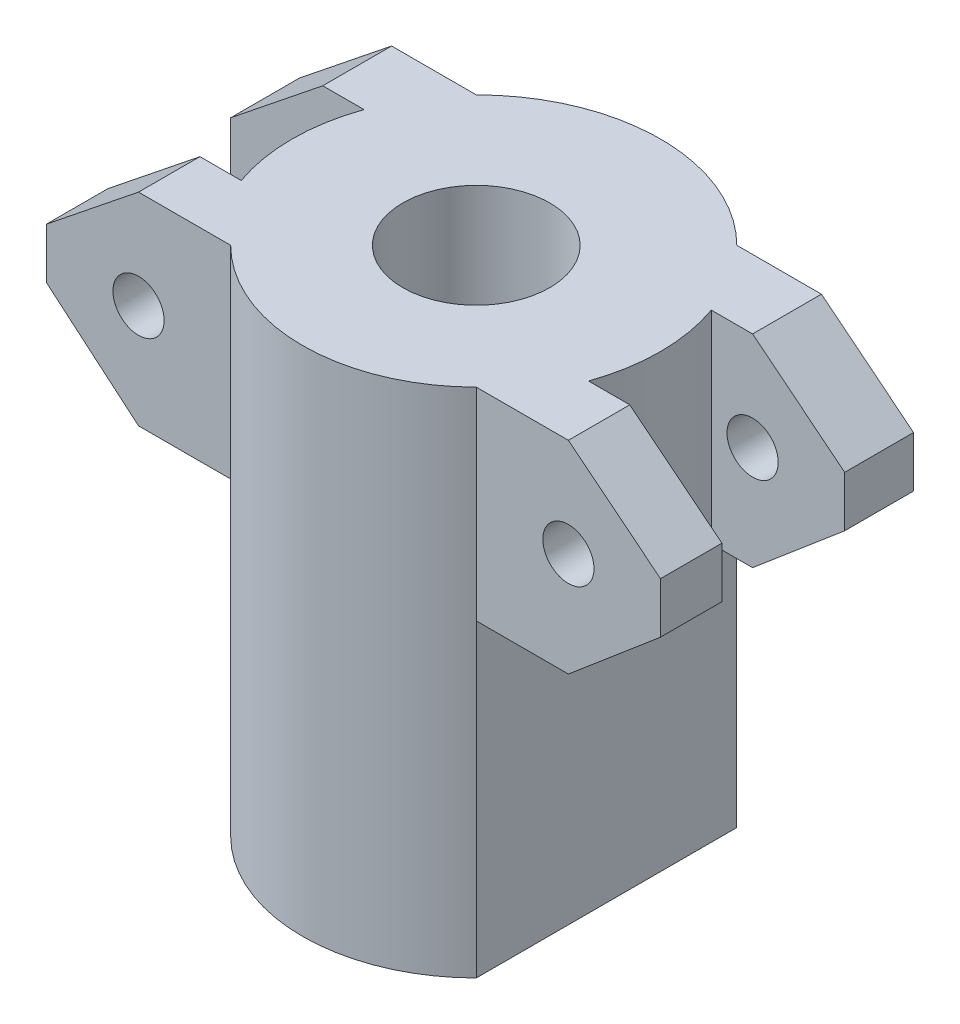
ISO-10303-21;
HEADER;
FILE_DESCRIPTION(('STEP AP214'),'2;1');
FILE_NAME('part.step','',(''),(''),'','','');
FILE_SCHEMA(('AUTOMOTIVE_DESIGN { 1 0 10303 214 1 1 1 1 }'));
ENDSEC;
DATA;
#1=APPLICATION_CONTEXT('core data for automotive mechanical design processes');
#2=APPLICATION_PROTOCOL_DEFINITION('international standard','automotive_design',2000,#1);
#3=PRODUCT_CONTEXT('',#1,'mechanical');
#4=PRODUCT('Part','Part','',(#3));
#5=PRODUCT_RELATED_PRODUCT_CATEGORY('part','',(#4));
#6=PRODUCT_DEFINITION_FORMATION('','',#4);
#7=PRODUCT_DEFINITION_CONTEXT('part definition',#1,'design');
#8=PRODUCT_DEFINITION('design','',#6,#7);
#9=PRODUCT_DEFINITION_SHAPE('','',#8);
#10=(LENGTH_UNIT() NAMED_UNIT(*) SI_UNIT(.MILLI.,.METRE.));
#11=(NAMED_UNIT(*) PLANE_ANGLE_UNIT() SI_UNIT($,.RADIAN.));
#12=(NAMED_UNIT(*) SI_UNIT($,.STERADIAN.) SOLID_ANGLE_UNIT());
#13=UNCERTAINTY_MEASURE_WITH_UNIT(LENGTH_MEASURE(1.E-05),#10,'distance_accuracy_value','');
#14=(GEOMETRIC_REPRESENTATION_CONTEXT(3) GLOBAL_UNCERTAINTY_ASSIGNED_CONTEXT((#13)) GLOBAL_UNIT_ASSIGNED_CONTEXT((#10,
#11,#12)) REPRESENTATION_CONTEXT('',''));
#15=CARTESIAN_POINT('',(0.,0.,0.));
#16=DIRECTION('',(0.,0.,1.));
#17=DIRECTION('',(1.,0.,0.));
#18=AXIS2_PLACEMENT_3D('',#15,#16,#17);
#19=CARTESIAN_POINT('',(0.,50.,0.));
#20=DIRECTION('',(0.,-1.,0.));
#21=DIRECTION('',(0.,0.,-1.));
#22=AXIS2_PLACEMENT_3D('',#19,#20,#21);
#23=PLANE('',#22);
#24=CARTESIAN_POINT('',(0.,50.,0.));
#25=DIRECTION('',(0.,1.,0.));
#26=DIRECTION('',(0.,0.,1.));
#27=AXIS2_PLACEMENT_3D('',#24,#25,#26);
#28=CIRCLE('',#27,7.17980327136209);
#29=CARTESIAN_POINT('',(0.,50.,7.17980327136211));
#30=VERTEX_POINT('',#29);
#31=EDGE_CURVE('E326',#30,#30,#28,.T.);
#32=ORIENTED_EDGE('',*,*,#31,.F.);
#33=EDGE_LOOP('',(#32));
#34=FACE_BOUND('',#33,.T.);
#35=DIRECTION('',(0.,0.,1.));
#36=VECTOR('',#35,1.);
#37=CARTESIAN_POINT('',(-21.,50.,-18.));
#38=LINE('',#37,#36);
#39=CARTESIAN_POINT('',(-21.,50.,6.));
#40=VERTEX_POINT('',#39);
#41=CARTESIAN_POINT('',(-21.,50.,12.));
#42=VERTEX_POINT('',#41);
#43=EDGE_CURVE('E434',#40,#42,#38,.T.);
#44=ORIENTED_EDGE('',*,*,#43,.T.);
#45=DIRECTION('',(1.,0.,0.));
#46=VECTOR('',#45,1.);
#47=CARTESIAN_POINT('',(-30.,50.,12.));
#48=LINE('',#47,#46);
#49=CARTESIAN_POINT('',(-12.,50.,12.));
#50=VERTEX_POINT('',#49);
#51=EDGE_CURVE('E340',#42,#50,#48,.T.);
#52=ORIENTED_EDGE('',*,*,#51,.T.);
#53=CARTESIAN_POINT('',(0.,50.,0.));
#54=DIRECTION('',(0.,1.,0.));
#55=DIRECTION('',(0.,0.,1.));
#56=AXIS2_PLACEMENT_3D('',#53,#54,#55);
#57=CIRCLE('',#56,16.9705627484772);
#58=CARTESIAN_POINT('',(12.,50.,12.));
#59=VERTEX_POINT('',#58);
#60=EDGE_CURVE('E342',#50,#59,#57,.T.);
#61=ORIENTED_EDGE('',*,*,#60,.T.);
#62=DIRECTION('',(1.,0.,0.));
#63=VECTOR('',#62,1.);
#64=CARTESIAN_POINT('',(30.,50.,12.));
#65=LINE('',#64,#63);
#66=CARTESIAN_POINT('',(21.,50.,12.));
#67=VERTEX_POINT('',#66);
#68=EDGE_CURVE('E344',#59,#67,#65,.T.);
#69=ORIENTED_EDGE('',*,*,#68,.T.);
#70=DIRECTION('',(0.,0.,1.));
#71=VECTOR('',#70,1.);
#72=CARTESIAN_POINT('',(21.,50.,-18.));
#73=LINE('',#72,#71);
#74=CARTESIAN_POINT('',(21.,50.,6.));
#75=VERTEX_POINT('',#74);
#76=EDGE_CURVE('E441',#75,#67,#73,.T.);
#77=ORIENTED_EDGE('',*,*,#76,.F.);
#78=DIRECTION('',(-1.,0.,0.));
#79=VECTOR('',#78,1.);
#80=CARTESIAN_POINT('',(16.9638434938271,50.,6.));
#81=LINE('',#80,#79);
#82=CARTESIAN_POINT('',(16.9638434938271,50.,6.));
#83=VERTEX_POINT('',#82);
#84=EDGE_CURVE('E347',#75,#83,#81,.T.);
#85=ORIENTED_EDGE('',*,*,#84,.T.);
#86=CARTESIAN_POINT('',(0.,50.,0.));
#87=DIRECTION('',(0.,1.,0.));
#88=DIRECTION('',(0.,0.,-1.));
#89=AXIS2_PLACEMENT_3D('',#86,#87,#88);
#90=CIRCLE('',#89,17.9936651653592);
#91=CARTESIAN_POINT('',(16.9638434938271,50.,-6.));
#92=VERTEX_POINT('',#91);
#93=EDGE_CURVE('E349',#83,#92,#90,.T.);
#94=ORIENTED_EDGE('',*,*,#93,.T.);
#95=DIRECTION('',(1.,0.,0.));
#96=VECTOR('',#95,1.);
#97=CARTESIAN_POINT('',(30.,50.,-6.));
#98=LINE('',#97,#96);
#99=CARTESIAN_POINT('',(21.,50.,-6.));
#100=VERTEX_POINT('',#99);
#101=EDGE_CURVE('E351',#92,#100,#98,.T.);
#102=ORIENTED_EDGE('',*,*,#101,.T.);
#103=CARTESIAN_POINT('',(21.,50.,-12.7279220613578));
#104=VERTEX_POINT('',#103);
#105=EDGE_CURVE('E438',#104,#100,#73,.T.);
#106=ORIENTED_EDGE('',*,*,#105,.F.);
#107=DIRECTION('',(-1.,0.,0.));
#108=VECTOR('',#107,1.);
#109=CARTESIAN_POINT('',(30.,50.,-12.7279220613578));
#110=LINE('',#109,#108);
#111=CARTESIAN_POINT('',(12.7279220613578,50.,-12.7279220613578));
#112=VERTEX_POINT('',#111);
#113=EDGE_CURVE('E354',#104,#112,#110,.T.);
#114=ORIENTED_EDGE('',*,*,#113,.T.);
#115=CARTESIAN_POINT('',(0.,50.,0.));
#116=DIRECTION('',(0.,1.,0.));
#117=DIRECTION('',(0.,0.,-1.));
#118=AXIS2_PLACEMENT_3D('',#115,#116,#117);
#119=CIRCLE('',#118,18.);
#120=CARTESIAN_POINT('',(-12.7279220613578,50.,-12.7279220613578));
#121=VERTEX_POINT('',#120);
#122=EDGE_CURVE('E356',#112,#121,#119,.T.);
#123=ORIENTED_EDGE('',*,*,#122,.T.);
#124=DIRECTION('',(-1.,0.,0.));
#125=VECTOR('',#124,1.);
#126=CARTESIAN_POINT('',(-30.,50.,-12.7279220613578));
#127=LINE('',#126,#125);
#128=CARTESIAN_POINT('',(-21.,50.,-12.7279220613578));
#129=VERTEX_POINT('',#128);
#130=EDGE_CURVE('E225',#121,#129,#127,.T.);
#131=ORIENTED_EDGE('',*,*,#130,.T.);
#132=CARTESIAN_POINT('',(-21.,50.,-6.));
#133=VERTEX_POINT('',#132);
#134=EDGE_CURVE('E258',#129,#133,#38,.T.);
#135=ORIENTED_EDGE('',*,*,#134,.T.);
#136=DIRECTION('',(1.,0.,0.));
#137=VECTOR('',#136,1.);
#138=CARTESIAN_POINT('',(-30.,50.,-6.));
#139=LINE('',#138,#137);
#140=CARTESIAN_POINT('',(-16.9638434938271,50.,-6.));
#141=VERTEX_POINT('',#140);
#142=EDGE_CURVE('E333',#133,#141,#139,.T.);
#143=ORIENTED_EDGE('',*,*,#142,.T.);
#144=CARTESIAN_POINT('',(0.,50.,0.));
#145=DIRECTION('',(0.,1.,0.));
#146=DIRECTION('',(0.,0.,1.));
#147=AXIS2_PLACEMENT_3D('',#144,#145,#146);
#148=CIRCLE('',#147,17.9936651653592);
#149=CARTESIAN_POINT('',(-16.9638434938271,50.,5.99999999999999));
#150=VERTEX_POINT('',#149);
#151=EDGE_CURVE('E335',#141,#150,#148,.T.);
#152=ORIENTED_EDGE('',*,*,#151,.T.);
#153=DIRECTION('',(-1.,0.,0.));
#154=VECTOR('',#153,1.);
#155=CARTESIAN_POINT('',(-16.9638434938271,50.,6.));
#156=LINE('',#155,#154);
#157=EDGE_CURVE('E337',#150,#40,#156,.T.);
#158=ORIENTED_EDGE('',*,*,#157,.T.);
#159=EDGE_LOOP('',(#44,#52,#61,#69,#77,#85,#94,#102,#106,#114,#123,#131,#135,#143,#152,#158));
#160=FACE_BOUND('',#159,.T.);
#161=ADVANCED_FACE('F36',(#34,#160),#23,.F.);
#162=CARTESIAN_POINT('',(0.,0.,0.));
#163=DIRECTION('',(0.,-1.,0.));
#164=DIRECTION('',(0.,0.,-1.));
#165=AXIS2_PLACEMENT_3D('',#162,#163,#164);
#166=PLANE('',#165);
#167=CARTESIAN_POINT('',(0.,0.,0.));
#168=DIRECTION('',(0.,1.,0.));
#169=DIRECTION('',(0.,0.,1.));
#170=AXIS2_PLACEMENT_3D('',#167,#168,#169);
#171=CIRCLE('',#170,7.17980327136209);
#172=CARTESIAN_POINT('',(0.,0.,7.17980327136211));
#173=VERTEX_POINT('',#172);
#174=EDGE_CURVE('E325',#173,#173,#171,.T.);
#175=ORIENTED_EDGE('',*,*,#174,.T.);
#176=EDGE_LOOP('',(#175));
#177=FACE_BOUND('',#176,.T.);
#178=CARTESIAN_POINT('',(0.,0.,0.));
#179=DIRECTION('',(0.,1.,0.));
#180=DIRECTION('',(0.,0.,-1.));
#181=AXIS2_PLACEMENT_3D('',#178,#179,#180);
#182=CIRCLE('',#181,18.);
#183=CARTESIAN_POINT('',(12.,0.,-13.4164078649987));
#184=VERTEX_POINT('',#183);
#185=CARTESIAN_POINT('',(-12.,0.,-13.4164078649987));
#186=VERTEX_POINT('',#185);
#187=EDGE_CURVE('E215',#184,#186,#182,.T.);
#188=ORIENTED_EDGE('',*,*,#187,.F.);
#189=DIRECTION('',(0.,0.,1.));
#190=VECTOR('',#189,1.);
#191=CARTESIAN_POINT('',(12.,0.,-18.));
#192=LINE('',#191,#190);
#193=CARTESIAN_POINT('',(12.,0.,12.));
#194=VERTEX_POINT('',#193);
#195=EDGE_CURVE('E239',#184,#194,#192,.T.);
#196=ORIENTED_EDGE('',*,*,#195,.T.);
#197=CARTESIAN_POINT('',(0.,0.,0.));
#198=DIRECTION('',(0.,1.,0.));
#199=DIRECTION('',(0.,0.,1.));
#200=AXIS2_PLACEMENT_3D('',#197,#198,#199);
#201=CIRCLE('',#200,16.9705627484772);
#202=CARTESIAN_POINT('',(-12.,0.,12.));
#203=VERTEX_POINT('',#202);
#204=EDGE_CURVE('E226',#203,#194,#201,.T.);
#205=ORIENTED_EDGE('',*,*,#204,.F.);
#206=DIRECTION('',(0.,0.,1.));
#207=VECTOR('',#206,1.);
#208=CARTESIAN_POINT('',(-12.,0.,-18.));
#209=LINE('',#208,#207);
#210=EDGE_CURVE('E231',#186,#203,#209,.T.);
#211=ORIENTED_EDGE('',*,*,#210,.F.);
#212=EDGE_LOOP('',(#188,#196,#205,#211));
#213=FACE_BOUND('',#212,.T.);
#214=ADVANCED_FACE('F238',(#177,#213),#166,.T.);
#215=CARTESIAN_POINT('',(-30.,50.,-12.7279220613578));
#216=DIRECTION('',(0.,0.,1.));
#217=DIRECTION('',(1.,0.,0.));
#218=AXIS2_PLACEMENT_3D('',#215,#216,#217);
#219=PLANE('',#218);
#220=CARTESIAN_POINT('',(-21.,40.3819584385632,-12.7279220613578));
#221=DIRECTION('',(0.,0.,1.));
#222=DIRECTION('',(1.,0.,0.));
#223=AXIS2_PLACEMENT_3D('',#220,#221,#222);
#224=CIRCLE('',#223,2.5);
#225=CARTESIAN_POINT('',(-18.5,40.3819584385632,-12.7279220613578));
#226=VERTEX_POINT('',#225);
#227=EDGE_CURVE('E322',#226,#226,#224,.T.);
#228=ORIENTED_EDGE('',*,*,#227,.T.);
#229=EDGE_LOOP('',(#228));
#230=FACE_BOUND('',#229,.T.);
#231=DIRECTION('',(-0.780528192542637,-0.6251205808851,0.));
#232=VECTOR('',#231,1.);
#233=CARTESIAN_POINT('',(-26.4830183341849,45.608681865925,-12.7279220613578));
#234=LINE('',#233,#232);
#235=CARTESIAN_POINT('',(-30.,42.7919512943684,-12.7279220613578));
#236=VERTEX_POINT('',#235);
#237=EDGE_CURVE('E313',#129,#236,#234,.T.);
#238=ORIENTED_EDGE('',*,*,#237,.F.);
#239=ORIENTED_EDGE('',*,*,#130,.F.);
#240=DIRECTION('',(0.,-1.,0.));
#241=VECTOR('',#240,1.);
#242=CARTESIAN_POINT('',(-12.7279220613578,50.,-12.7279220613578));
#243=LINE('',#242,#241);
#244=CARTESIAN_POINT('',(-12.7279220613578,30.2209074789521,-12.7279220613578));
#245=VERTEX_POINT('',#244);
#246=EDGE_CURVE('E358',#121,#245,#243,.T.);
#247=ORIENTED_EDGE('',*,*,#246,.T.);
#248=DIRECTION('',(1.,0.,0.));
#249=VECTOR('',#248,1.);
#250=CARTESIAN_POINT('',(-30.,30.2209074789521,-12.7279220613578));
#251=LINE('',#250,#249);
#252=CARTESIAN_POINT('',(-21.,30.2209074789521,-12.7279220613578));
#253=VERTEX_POINT('',#252);
#254=EDGE_CURVE('E255',#253,#245,#251,.T.);
#255=ORIENTED_EDGE('',*,*,#254,.F.);
#256=DIRECTION('',(0.763160297776906,-0.646209223005262,0.));
#257=VECTOR('',#256,1.);
#258=CARTESIAN_POINT('',(-35.996004219522,42.9188377343777,-12.7279220613578));
#259=LINE('',#258,#257);
#260=CARTESIAN_POINT('',(-30.,37.8416956986605,-12.7279220613578));
#261=VERTEX_POINT('',#260);
#262=EDGE_CURVE('E307',#261,#253,#259,.T.);
#263=ORIENTED_EDGE('',*,*,#262,.F.);
#264=DIRECTION('',(0.,-1.,0.));
#265=VECTOR('',#264,1.);
#266=CARTESIAN_POINT('',(-30.,50.,-12.7279220613578));
#267=LINE('',#266,#265);
#268=EDGE_CURVE('E404',#236,#261,#267,.T.);
#269=ORIENTED_EDGE('',*,*,#268,.F.);
#270=EDGE_LOOP('',(#238,#239,#247,#255,#263,#269));
#271=FACE_BOUND('',#270,.T.);
#272=ADVANCED_FACE('F38',(#230,#271),#219,.F.);
#273=CARTESIAN_POINT('',(-30.,50.,-12.7279220613578));
#274=DIRECTION('',(1.,0.,0.));
#275=DIRECTION('',(0.,0.,-1.));
#276=AXIS2_PLACEMENT_3D('',#273,#274,#275);
#277=PLANE('',#276);
#278=DIRECTION('',(0.,0.,1.));
#279=VECTOR('',#278,1.);
#280=CARTESIAN_POINT('',(-30.,42.7919512943684,-18.));
#281=LINE('',#280,#279);
#282=CARTESIAN_POINT('',(-30.,42.7919512943684,-6.));
#283=VERTEX_POINT('',#282);
#284=EDGE_CURVE('E51',#236,#283,#281,.T.);
#285=ORIENTED_EDGE('',*,*,#284,.F.);
#286=ORIENTED_EDGE('',*,*,#268,.T.);
#287=DIRECTION('',(0.,0.,1.));
#288=VECTOR('',#287,1.);
#289=CARTESIAN_POINT('',(-30.,37.8416956986605,-18.));
#290=LINE('',#289,#288);
#291=CARTESIAN_POINT('',(-30.,37.8416956986605,-6.));
#292=VERTEX_POINT('',#291);
#293=EDGE_CURVE('E250',#261,#292,#290,.T.);
#294=ORIENTED_EDGE('',*,*,#293,.T.);
#295=DIRECTION('',(0.,-1.,0.));
#296=VECTOR('',#295,1.);
#297=CARTESIAN_POINT('',(-30.,50.,-6.));
#298=LINE('',#297,#296);
#299=EDGE_CURVE('E401',#283,#292,#298,.T.);
#300=ORIENTED_EDGE('',*,*,#299,.F.);
#301=EDGE_LOOP('',(#285,#286,#294,#300));
#302=FACE_BOUND('',#301,.T.);
#303=ADVANCED_FACE('F597',(#302),#277,.F.);
#304=CARTESIAN_POINT('',(-30.,50.,-6.));
#305=DIRECTION('',(0.,0.,-1.));
#306=DIRECTION('',(-1.,0.,0.));
#307=AXIS2_PLACEMENT_3D('',#304,#305,#306);
#308=PLANE('',#307);
#309=CARTESIAN_POINT('',(-21.,40.3819584385632,-6.));
#310=DIRECTION('',(0.,0.,-1.));
#311=DIRECTION('',(-1.,0.,0.));
#312=AXIS2_PLACEMENT_3D('',#309,#310,#311);
#313=CIRCLE('',#312,2.5);
#314=CARTESIAN_POINT('',(-23.5,40.3819584385632,-6.));
#315=VERTEX_POINT('',#314);
#316=EDGE_CURVE('E319',#315,#315,#313,.T.);
#317=ORIENTED_EDGE('',*,*,#316,.T.);
#318=EDGE_LOOP('',(#317));
#319=FACE_BOUND('',#318,.T.);
#320=DIRECTION('',(0.780528192542637,0.6251205808851,0.));
#321=VECTOR('',#320,1.);
#322=CARTESIAN_POINT('',(-26.4830183341849,45.608681865925,-6.));
#323=LINE('',#322,#321);
#324=EDGE_CURVE('E311',#283,#133,#323,.T.);
#325=ORIENTED_EDGE('',*,*,#324,.F.);
#326=ORIENTED_EDGE('',*,*,#299,.T.);
#327=DIRECTION('',(-0.763160297776906,0.646209223005262,0.));
#328=VECTOR('',#327,1.);
#329=CARTESIAN_POINT('',(-35.996004219522,42.9188377343777,-6.));
#330=LINE('',#329,#328);
#331=CARTESIAN_POINT('',(-21.,30.2209074789521,-6.));
#332=VERTEX_POINT('',#331);
#333=EDGE_CURVE('E305',#332,#292,#330,.T.);
#334=ORIENTED_EDGE('',*,*,#333,.F.);
#335=DIRECTION('',(-1.,0.,0.));
#336=VECTOR('',#335,1.);
#337=CARTESIAN_POINT('',(-30.,30.2209074789521,-6.));
#338=LINE('',#337,#336);
#339=CARTESIAN_POINT('',(-16.9638434938271,30.2209074789521,-6.));
#340=VERTEX_POINT('',#339);
#341=EDGE_CURVE('E264',#340,#332,#338,.T.);
#342=ORIENTED_EDGE('',*,*,#341,.F.);
#343=DIRECTION('',(0.,-1.,0.));
#344=VECTOR('',#343,1.);
#345=CARTESIAN_POINT('',(-16.9638434938271,50.,-6.));
#346=LINE('',#345,#344);
#347=EDGE_CURVE('E398',#141,#340,#346,.T.);
#348=ORIENTED_EDGE('',*,*,#347,.F.);
#349=ORIENTED_EDGE('',*,*,#142,.F.);
#350=EDGE_LOOP('',(#325,#326,#334,#342,#348,#349));
#351=FACE_BOUND('',#350,.T.);
#352=ADVANCED_FACE('F594',(#319,#351),#308,.F.);
#353=CARTESIAN_POINT('',(0.,50.,0.));
#354=DIRECTION('',(0.,-1.,0.));
#355=DIRECTION('',(0.,0.,-1.));
#356=AXIS2_PLACEMENT_3D('',#353,#354,#355);
#357=CYLINDRICAL_SURFACE('',#356,17.9936651653592);
#358=CARTESIAN_POINT('',(0.,30.2209074789521,0.));
#359=DIRECTION('',(0.,-1.,0.));
#360=DIRECTION('',(0.,0.,-1.));
#361=AXIS2_PLACEMENT_3D('',#358,#359,#360);
#362=CIRCLE('',#361,17.9936651653592);
#363=CARTESIAN_POINT('',(-16.9638434938271,30.2209074789521,6.));
#364=VERTEX_POINT('',#363);
#365=EDGE_CURVE('E262',#364,#340,#362,.T.);
#366=ORIENTED_EDGE('',*,*,#365,.F.);
#367=DIRECTION('',(0.,-1.,0.));
#368=VECTOR('',#367,1.);
#369=CARTESIAN_POINT('',(-16.9638434938271,50.,5.99999999999999));
#370=LINE('',#369,#368);
#371=EDGE_CURVE('E395',#150,#364,#370,.T.);
#372=ORIENTED_EDGE('',*,*,#371,.F.);
#373=ORIENTED_EDGE('',*,*,#151,.F.);
#374=ORIENTED_EDGE('',*,*,#347,.T.);
#375=EDGE_LOOP('',(#366,#372,#373,#374));
#376=FACE_BOUND('',#375,.T.);
#377=ADVANCED_FACE('F590',(#376),#357,.T.);
#378=CARTESIAN_POINT('',(-16.9638434938271,50.,6.));
#379=DIRECTION('',(0.,0.,1.));
#380=DIRECTION('',(1.,0.,0.));
#381=AXIS2_PLACEMENT_3D('',#378,#379,#380);
#382=PLANE('',#381);
#383=CARTESIAN_POINT('',(-21.,40.3819584385632,6.));
#384=DIRECTION('',(0.,0.,1.));
#385=DIRECTION('',(1.,0.,0.));
#386=AXIS2_PLACEMENT_3D('',#383,#384,#385);
#387=CIRCLE('',#386,2.5);
#388=CARTESIAN_POINT('',(-18.5,40.3819584385632,6.));
#389=VERTEX_POINT('',#388);
#390=EDGE_CURVE('E316',#389,#389,#387,.T.);
#391=ORIENTED_EDGE('',*,*,#390,.T.);
#392=EDGE_LOOP('',(#391));
#393=FACE_BOUND('',#392,.T.);
#394=DIRECTION('',(-0.780528192542637,-0.6251205808851,0.));
#395=VECTOR('',#394,1.);
#396=CARTESIAN_POINT('',(-18.5410755418905,51.9693385841691,6.));
#397=LINE('',#396,#395);
#398=CARTESIAN_POINT('',(-30.,42.7919512943684,6.));
#399=VERTEX_POINT('',#398);
#400=EDGE_CURVE('E309',#40,#399,#397,.T.);
#401=ORIENTED_EDGE('',*,*,#400,.F.);
#402=ORIENTED_EDGE('',*,*,#157,.F.);
#403=ORIENTED_EDGE('',*,*,#371,.T.);
#404=DIRECTION('',(1.,0.,0.));
#405=VECTOR('',#404,1.);
#406=CARTESIAN_POINT('',(-16.9638434938271,30.2209074789521,6.));
#407=LINE('',#406,#405);
#408=CARTESIAN_POINT('',(-21.,30.2209074789521,6.));
#409=VERTEX_POINT('',#408);
#410=EDGE_CURVE('E260',#409,#364,#407,.T.);
#411=ORIENTED_EDGE('',*,*,#410,.F.);
#412=DIRECTION('',(0.763160297776906,-0.646209223005262,0.));
#413=VECTOR('',#412,1.);
#414=CARTESIAN_POINT('',(-28.4035688558103,36.4899108478586,6.));
#415=LINE('',#414,#413);
#416=CARTESIAN_POINT('',(-30.,37.8416956986605,6.));
#417=VERTEX_POINT('',#416);
#418=EDGE_CURVE('E303',#417,#409,#415,.T.);
#419=ORIENTED_EDGE('',*,*,#418,.F.);
#420=DIRECTION('',(0.,-1.,0.));
#421=VECTOR('',#420,1.);
#422=CARTESIAN_POINT('',(-30.,50.,6.));
#423=LINE('',#422,#421);
#424=EDGE_CURVE('E392',#399,#417,#423,.T.);
#425=ORIENTED_EDGE('',*,*,#424,.F.);
#426=EDGE_LOOP('',(#401,#402,#403,#411,#419,#425));
#427=FACE_BOUND('',#426,.T.);
#428=ADVANCED_FACE('F587',(#393,#427),#382,.F.);
#429=CARTESIAN_POINT('',(-30.,50.,6.));
#430=DIRECTION('',(1.,0.,0.));
#431=DIRECTION('',(0.,0.,-1.));
#432=AXIS2_PLACEMENT_3D('',#429,#430,#431);
#433=PLANE('',#432);
#434=CARTESIAN_POINT('',(-30.,42.7919512943684,12.));
#435=VERTEX_POINT('',#434);
#436=EDGE_CURVE('E58',#399,#435,#281,.T.);
#437=ORIENTED_EDGE('',*,*,#436,.F.);
#438=ORIENTED_EDGE('',*,*,#424,.T.);
#439=CARTESIAN_POINT('',(-30.,37.8416956986605,12.));
#440=VERTEX_POINT('',#439);
#441=EDGE_CURVE('E251',#417,#440,#290,.T.);
#442=ORIENTED_EDGE('',*,*,#441,.T.);
#443=DIRECTION('',(0.,-1.,0.));
#444=VECTOR('',#443,1.);
#445=CARTESIAN_POINT('',(-30.,50.,12.));
#446=LINE('',#445,#444);
#447=EDGE_CURVE('E389',#435,#440,#446,.T.);
#448=ORIENTED_EDGE('',*,*,#447,.F.);
#449=EDGE_LOOP('',(#437,#438,#442,#448));
#450=FACE_BOUND('',#449,.T.);
#451=ADVANCED_FACE('F427',(#450),#433,.F.);
#452=CARTESIAN_POINT('',(-30.,50.,12.));
#453=DIRECTION('',(0.,0.,-1.));
#454=DIRECTION('',(-1.,0.,0.));
#455=AXIS2_PLACEMENT_3D('',#452,#453,#454);
#456=PLANE('',#455);
#457=CARTESIAN_POINT('',(-21.,40.3819584385632,12.));
#458=DIRECTION('',(0.,0.,-1.));
#459=DIRECTION('',(-1.,0.,0.));
#460=AXIS2_PLACEMENT_3D('',#457,#458,#459);
#461=CIRCLE('',#460,2.5);
#462=CARTESIAN_POINT('',(-23.5,40.3819584385632,12.));
#463=VERTEX_POINT('',#462);
#464=EDGE_CURVE('E315',#463,#463,#461,.T.);
#465=ORIENTED_EDGE('',*,*,#464,.T.);
#466=EDGE_LOOP('',(#465));
#467=FACE_BOUND('',#466,.T.);
#468=DIRECTION('',(0.780528192542637,0.6251205808851,0.));
#469=VECTOR('',#468,1.);
#470=CARTESIAN_POINT('',(-26.4830183341849,45.608681865925,12.));
#471=LINE('',#470,#469);
#472=EDGE_CURVE('E12',#435,#42,#471,.T.);
#473=ORIENTED_EDGE('',*,*,#472,.F.);
#474=ORIENTED_EDGE('',*,*,#447,.T.);
#475=DIRECTION('',(-0.763160297776906,0.646209223005262,0.));
#476=VECTOR('',#475,1.);
#477=CARTESIAN_POINT('',(-35.996004219522,42.9188377343777,12.));
#478=LINE('',#477,#476);
#479=CARTESIAN_POINT('',(-21.,30.2209074789521,12.));
#480=VERTEX_POINT('',#479);
#481=EDGE_CURVE('E44',#480,#440,#478,.T.);
#482=ORIENTED_EDGE('',*,*,#481,.F.);
#483=DIRECTION('',(-1.,0.,0.));
#484=VECTOR('',#483,1.);
#485=CARTESIAN_POINT('',(-30.,30.2209074789521,12.));
#486=LINE('',#485,#484);
#487=CARTESIAN_POINT('',(-12.,30.2209074789521,12.));
#488=VERTEX_POINT('',#487);
#489=EDGE_CURVE('E257',#488,#480,#486,.T.);
#490=ORIENTED_EDGE('',*,*,#489,.F.);
#491=DIRECTION('',(0.,-1.,0.));
#492=VECTOR('',#491,1.);
#493=CARTESIAN_POINT('',(-12.,50.,12.));
#494=LINE('',#493,#492);
#495=EDGE_CURVE('E386',#50,#488,#494,.T.);
#496=ORIENTED_EDGE('',*,*,#495,.F.);
#497=ORIENTED_EDGE('',*,*,#51,.F.);
#498=EDGE_LOOP('',(#473,#474,#482,#490,#496,#497));
#499=FACE_BOUND('',#498,.T.);
#500=ADVANCED_FACE('F429',(#467,#499),#456,.F.);
#501=CARTESIAN_POINT('',(30.,50.,12.));
#502=DIRECTION('',(0.,0.,-1.));
#503=DIRECTION('',(-1.,0.,0.));
#504=AXIS2_PLACEMENT_3D('',#501,#502,#503);
#505=PLANE('',#504);
#506=CARTESIAN_POINT('',(21.,40.3819584385632,12.));
#507=DIRECTION('',(0.,0.,-1.));
#508=DIRECTION('',(-1.,0.,0.));
#509=AXIS2_PLACEMENT_3D('',#506,#507,#508);
#510=CIRCLE('',#509,2.50000000000001);
#511=CARTESIAN_POINT('',(18.5,40.3819584385632,12.));
#512=VERTEX_POINT('',#511);
#513=EDGE_CURVE('E288',#512,#512,#510,.T.);
#514=ORIENTED_EDGE('',*,*,#513,.T.);
#515=EDGE_LOOP('',(#514));
#516=FACE_BOUND('',#515,.T.);
#517=DIRECTION('',(0.780528192542636,-0.6251205808851,0.));
#518=VECTOR('',#517,1.);
#519=CARTESIAN_POINT('',(26.4830183341849,45.608681865925,12.));
#520=LINE('',#519,#518);
#521=CARTESIAN_POINT('',(30.,42.7919512943684,12.));
#522=VERTEX_POINT('',#521);
#523=EDGE_CURVE('E301',#67,#522,#520,.T.);
#524=ORIENTED_EDGE('',*,*,#523,.F.);
#525=ORIENTED_EDGE('',*,*,#68,.F.);
#526=DIRECTION('',(0.,-1.,0.));
#527=VECTOR('',#526,1.);
#528=CARTESIAN_POINT('',(12.,50.,12.));
#529=LINE('',#528,#527);
#530=CARTESIAN_POINT('',(12.,30.2209074789521,12.));
#531=VERTEX_POINT('',#530);
#532=EDGE_CURVE('E383',#59,#531,#529,.T.);
#533=ORIENTED_EDGE('',*,*,#532,.T.);
#534=DIRECTION('',(-1.,0.,0.));
#535=VECTOR('',#534,1.);
#536=CARTESIAN_POINT('',(30.,30.2209074789521,12.));
#537=LINE('',#536,#535);
#538=CARTESIAN_POINT('',(21.,30.2209074789521,12.));
#539=VERTEX_POINT('',#538);
#540=EDGE_CURVE('E279',#539,#531,#537,.T.);
#541=ORIENTED_EDGE('',*,*,#540,.F.);
#542=DIRECTION('',(-0.763160297776906,-0.646209223005262,0.));
#543=VECTOR('',#542,1.);
#544=CARTESIAN_POINT('',(35.996004219522,42.9188377343777,12.));
#545=LINE('',#544,#543);
#546=CARTESIAN_POINT('',(30.,37.8416956986605,12.));
#547=VERTEX_POINT('',#546);
#548=EDGE_CURVE('E295',#547,#539,#545,.T.);
#549=ORIENTED_EDGE('',*,*,#548,.F.);
#550=DIRECTION('',(0.,-1.,0.));
#551=VECTOR('',#550,1.);
#552=CARTESIAN_POINT('',(30.,50.,12.));
#553=LINE('',#552,#551);
#554=EDGE_CURVE('E380',#522,#547,#553,.T.);
#555=ORIENTED_EDGE('',*,*,#554,.F.);
#556=EDGE_LOOP('',(#524,#525,#533,#541,#549,#555));
#557=FACE_BOUND('',#556,.T.);
#558=ADVANCED_FACE('F468',(#516,#557),#505,.F.);
#559=CARTESIAN_POINT('',(30.,50.,6.));
#560=DIRECTION('',(-1.,0.,0.));
#561=DIRECTION('',(0.,0.,1.));
#562=AXIS2_PLACEMENT_3D('',#559,#560,#561);
#563=PLANE('',#562);
#564=DIRECTION('',(0.,0.,1.));
#565=VECTOR('',#564,1.);
#566=CARTESIAN_POINT('',(30.,42.7919512943684,-18.));
#567=LINE('',#566,#565);
#568=CARTESIAN_POINT('',(30.,42.7919512943684,6.));
#569=VERTEX_POINT('',#568);
#570=EDGE_CURVE('E445',#569,#522,#567,.T.);
#571=ORIENTED_EDGE('',*,*,#570,.T.);
#572=ORIENTED_EDGE('',*,*,#554,.T.);
#573=DIRECTION('',(0.,0.,1.));
#574=VECTOR('',#573,1.);
#575=CARTESIAN_POINT('',(30.,37.8416956986605,-18.));
#576=LINE('',#575,#574);
#577=CARTESIAN_POINT('',(30.,37.8416956986605,6.));
#578=VERTEX_POINT('',#577);
#579=EDGE_CURVE('E449',#578,#547,#576,.T.);
#580=ORIENTED_EDGE('',*,*,#579,.F.);
#581=DIRECTION('',(0.,-1.,0.));
#582=VECTOR('',#581,1.);
#583=CARTESIAN_POINT('',(30.,50.,6.));
#584=LINE('',#583,#582);
#585=EDGE_CURVE('E377',#569,#578,#584,.T.);
#586=ORIENTED_EDGE('',*,*,#585,.F.);
#587=EDGE_LOOP('',(#571,#572,#580,#586));
#588=FACE_BOUND('',#587,.T.);
#589=ADVANCED_FACE('F530',(#588),#563,.F.);
#590=CARTESIAN_POINT('',(16.9638434938271,50.,6.));
#591=DIRECTION('',(0.,0.,1.));
#592=DIRECTION('',(1.,0.,0.));
#593=AXIS2_PLACEMENT_3D('',#590,#591,#592);
#594=PLANE('',#593);
#595=CARTESIAN_POINT('',(21.,40.3819584385632,6.));
#596=DIRECTION('',(0.,0.,1.));
#597=DIRECTION('',(1.,0.,0.));
#598=AXIS2_PLACEMENT_3D('',#595,#596,#597);
#599=CIRCLE('',#598,2.50000000000001);
#600=CARTESIAN_POINT('',(23.5,40.3819584385632,6.));
#601=VERTEX_POINT('',#600);
#602=EDGE_CURVE('E285',#601,#601,#599,.T.);
#603=ORIENTED_EDGE('',*,*,#602,.T.);
#604=EDGE_LOOP('',(#603));
#605=FACE_BOUND('',#604,.T.);
#606=DIRECTION('',(-0.780528192542636,0.6251205808851,0.));
#607=VECTOR('',#606,1.);
#608=CARTESIAN_POINT('',(18.5410755418905,51.9693385841691,6.));
#609=LINE('',#608,#607);
#610=EDGE_CURVE('E299',#569,#75,#609,.T.);
#611=ORIENTED_EDGE('',*,*,#610,.F.);
#612=ORIENTED_EDGE('',*,*,#585,.T.);
#613=DIRECTION('',(0.763160297776906,0.646209223005262,0.));
#614=VECTOR('',#613,1.);
#615=CARTESIAN_POINT('',(28.4035688558103,36.4899108478586,6.));
#616=LINE('',#615,#614);
#617=CARTESIAN_POINT('',(21.,30.2209074789521,6.));
#618=VERTEX_POINT('',#617);
#619=EDGE_CURVE('E293',#618,#578,#616,.T.);
#620=ORIENTED_EDGE('',*,*,#619,.F.);
#621=DIRECTION('',(1.,0.,0.));
#622=VECTOR('',#621,1.);
#623=CARTESIAN_POINT('',(16.9638434938271,30.2209074789521,6.));
#624=LINE('',#623,#622);
#625=CARTESIAN_POINT('',(16.9638434938271,30.2209074789521,6.));
#626=VERTEX_POINT('',#625);
#627=EDGE_CURVE('E277',#626,#618,#624,.T.);
#628=ORIENTED_EDGE('',*,*,#627,.F.);
#629=DIRECTION('',(0.,-1.,0.));
#630=VECTOR('',#629,1.);
#631=CARTESIAN_POINT('',(16.9638434938271,50.,6.));
#632=LINE('',#631,#630);
#633=EDGE_CURVE('E374',#83,#626,#632,.T.);
#634=ORIENTED_EDGE('',*,*,#633,.F.);
#635=ORIENTED_EDGE('',*,*,#84,.F.);
#636=EDGE_LOOP('',(#611,#612,#620,#628,#634,#635));
#637=FACE_BOUND('',#636,.T.);
#638=ADVANCED_FACE('F524',(#605,#637),#594,.F.);
#639=CARTESIAN_POINT('',(0.,50.,0.));
#640=DIRECTION('',(0.,-1.,0.));
#641=DIRECTION('',(0.,0.,-1.));
#642=AXIS2_PLACEMENT_3D('',#639,#640,#641);
#643=CYLINDRICAL_SURFACE('',#642,17.9936651653592);
#644=CARTESIAN_POINT('',(0.,30.2209074789521,0.));
#645=DIRECTION('',(0.,-1.,0.));
#646=DIRECTION('',(0.,0.,-1.));
#647=AXIS2_PLACEMENT_3D('',#644,#645,#646);
#648=CIRCLE('',#647,17.9936651653592);
#649=CARTESIAN_POINT('',(16.9638434938271,30.2209074789521,-6.));
#650=VERTEX_POINT('',#649);
#651=EDGE_CURVE('E275',#650,#626,#648,.T.);
#652=ORIENTED_EDGE('',*,*,#651,.F.);
#653=DIRECTION('',(0.,-1.,0.));
#654=VECTOR('',#653,1.);
#655=CARTESIAN_POINT('',(16.9638434938271,50.,-6.));
#656=LINE('',#655,#654);
#657=EDGE_CURVE('E371',#92,#650,#656,.T.);
#658=ORIENTED_EDGE('',*,*,#657,.F.);
#659=ORIENTED_EDGE('',*,*,#93,.F.);
#660=ORIENTED_EDGE('',*,*,#633,.T.);
#661=EDGE_LOOP('',(#652,#658,#659,#660));
#662=FACE_BOUND('',#661,.T.);
#663=ADVANCED_FACE('F518',(#662),#643,.T.);
#664=CARTESIAN_POINT('',(30.,50.,-6.));
#665=DIRECTION('',(0.,0.,-1.));
#666=DIRECTION('',(-1.,0.,0.));
#667=AXIS2_PLACEMENT_3D('',#664,#665,#666);
#668=PLANE('',#667);
#669=CARTESIAN_POINT('',(21.,40.3819584385632,-6.));
#670=DIRECTION('',(0.,0.,-1.));
#671=DIRECTION('',(-1.,0.,0.));
#672=AXIS2_PLACEMENT_3D('',#669,#670,#671);
#673=CIRCLE('',#672,2.50000000000001);
#674=CARTESIAN_POINT('',(18.5,40.3819584385632,-6.));
#675=VERTEX_POINT('',#674);
#676=EDGE_CURVE('E282',#675,#675,#673,.T.);
#677=ORIENTED_EDGE('',*,*,#676,.T.);
#678=EDGE_LOOP('',(#677));
#679=FACE_BOUND('',#678,.T.);
#680=DIRECTION('',(0.780528192542636,-0.6251205808851,0.));
#681=VECTOR('',#680,1.);
#682=CARTESIAN_POINT('',(26.4830183341849,45.608681865925,-6.));
#683=LINE('',#682,#681);
#684=CARTESIAN_POINT('',(30.,42.7919512943684,-6.));
#685=VERTEX_POINT('',#684);
#686=EDGE_CURVE('E297',#100,#685,#683,.T.);
#687=ORIENTED_EDGE('',*,*,#686,.F.);
#688=ORIENTED_EDGE('',*,*,#101,.F.);
#689=ORIENTED_EDGE('',*,*,#657,.T.);
#690=DIRECTION('',(-1.,0.,0.));
#691=VECTOR('',#690,1.);
#692=CARTESIAN_POINT('',(30.,30.2209074789521,-6.));
#693=LINE('',#692,#691);
#694=CARTESIAN_POINT('',(21.,30.2209074789521,-6.));
#695=VERTEX_POINT('',#694);
#696=EDGE_CURVE('E273',#695,#650,#693,.T.);
#697=ORIENTED_EDGE('',*,*,#696,.F.);
#698=DIRECTION('',(-0.763160297776906,-0.646209223005262,0.));
#699=VECTOR('',#698,1.);
#700=CARTESIAN_POINT('',(35.996004219522,42.9188377343777,-6.));
#701=LINE('',#700,#699);
#702=CARTESIAN_POINT('',(30.,37.8416956986605,-6.));
#703=VERTEX_POINT('',#702);
#704=EDGE_CURVE('E291',#703,#695,#701,.T.);
#705=ORIENTED_EDGE('',*,*,#704,.F.);
#706=DIRECTION('',(0.,-1.,0.));
#707=VECTOR('',#706,1.);
#708=CARTESIAN_POINT('',(30.,50.,-6.));
#709=LINE('',#708,#707);
#710=EDGE_CURVE('E368',#685,#703,#709,.T.);
#711=ORIENTED_EDGE('',*,*,#710,.F.);
#712=EDGE_LOOP('',(#687,#688,#689,#697,#705,#711));
#713=FACE_BOUND('',#712,.T.);
#714=ADVANCED_FACE('F505',(#679,#713),#668,.F.);
#715=CARTESIAN_POINT('',(30.,50.,-12.7279220613578));
#716=DIRECTION('',(-1.,0.,0.));
#717=DIRECTION('',(0.,0.,1.));
#718=AXIS2_PLACEMENT_3D('',#715,#716,#717);
#719=PLANE('',#718);
#720=CARTESIAN_POINT('',(30.,42.7919512943684,-12.7279220613578));
#721=VERTEX_POINT('',#720);
#722=EDGE_CURVE('E444',#721,#685,#567,.T.);
#723=ORIENTED_EDGE('',*,*,#722,.T.);
#724=ORIENTED_EDGE('',*,*,#710,.T.);
#725=CARTESIAN_POINT('',(30.,37.8416956986605,-12.7279220613578));
#726=VERTEX_POINT('',#725);
#727=EDGE_CURVE('E448',#726,#703,#576,.T.);
#728=ORIENTED_EDGE('',*,*,#727,.F.);
#729=DIRECTION('',(0.,-1.,0.));
#730=VECTOR('',#729,1.);
#731=CARTESIAN_POINT('',(30.,50.,-12.7279220613578));
#732=LINE('',#731,#730);
#733=EDGE_CURVE('E365',#721,#726,#732,.T.);
#734=ORIENTED_EDGE('',*,*,#733,.F.);
#735=EDGE_LOOP('',(#723,#724,#728,#734));
#736=FACE_BOUND('',#735,.T.);
#737=ADVANCED_FACE('F508',(#736),#719,.F.);
#738=CARTESIAN_POINT('',(30.,50.,-12.7279220613578));
#739=DIRECTION('',(0.,0.,1.));
#740=DIRECTION('',(1.,0.,0.));
#741=AXIS2_PLACEMENT_3D('',#738,#739,#740);
#742=PLANE('',#741);
#743=CARTESIAN_POINT('',(21.,40.3819584385632,-12.7279220613578));
#744=DIRECTION('',(0.,0.,1.));
#745=DIRECTION('',(1.,0.,0.));
#746=AXIS2_PLACEMENT_3D('',#743,#744,#745);
#747=CIRCLE('',#746,2.50000000000001);
#748=CARTESIAN_POINT('',(23.5,40.3819584385632,-12.7279220613578));
#749=VERTEX_POINT('',#748);
#750=EDGE_CURVE('E281',#749,#749,#747,.T.);
#751=ORIENTED_EDGE('',*,*,#750,.T.);
#752=EDGE_LOOP('',(#751));
#753=FACE_BOUND('',#752,.T.);
#754=DIRECTION('',(-0.780528192542636,0.6251205808851,0.));
#755=VECTOR('',#754,1.);
#756=CARTESIAN_POINT('',(26.4830183341849,45.608681865925,-12.7279220613578));
#757=LINE('',#756,#755);
#758=EDGE_CURVE('E417',#721,#104,#757,.T.);
#759=ORIENTED_EDGE('',*,*,#758,.F.);
#760=ORIENTED_EDGE('',*,*,#733,.T.);
#761=DIRECTION('',(0.763160297776906,0.646209223005262,0.));
#762=VECTOR('',#761,1.);
#763=CARTESIAN_POINT('',(35.996004219522,42.9188377343777,-12.7279220613578));
#764=LINE('',#763,#762);
#765=CARTESIAN_POINT('',(21.,30.2209074789521,-12.7279220613578));
#766=VERTEX_POINT('',#765);
#767=EDGE_CURVE('E413',#766,#726,#764,.T.);
#768=ORIENTED_EDGE('',*,*,#767,.F.);
#769=DIRECTION('',(1.,0.,0.));
#770=VECTOR('',#769,1.);
#771=CARTESIAN_POINT('',(30.,30.2209074789521,-12.7279220613578));
#772=LINE('',#771,#770);
#773=CARTESIAN_POINT('',(12.7279220613578,30.2209074789521,-12.7279220613578));
#774=VERTEX_POINT('',#773);
#775=EDGE_CURVE('E271',#774,#766,#772,.T.);
#776=ORIENTED_EDGE('',*,*,#775,.F.);
#777=DIRECTION('',(0.,-1.,0.));
#778=VECTOR('',#777,1.);
#779=CARTESIAN_POINT('',(12.7279220613578,50.,-12.7279220613578));
#780=LINE('',#779,#778);
#781=EDGE_CURVE('E362',#112,#774,#780,.T.);
#782=ORIENTED_EDGE('',*,*,#781,.F.);
#783=ORIENTED_EDGE('',*,*,#113,.F.);
#784=EDGE_LOOP('',(#759,#760,#768,#776,#782,#783));
#785=FACE_BOUND('',#784,.T.);
#786=ADVANCED_FACE('F492',(#753,#785),#742,.F.);
#787=CARTESIAN_POINT('',(0.,50.,0.));
#788=DIRECTION('',(0.,-1.,0.));
#789=DIRECTION('',(0.,0.,-1.));
#790=AXIS2_PLACEMENT_3D('',#787,#788,#789);
#791=CYLINDRICAL_SURFACE('',#790,18.);
#792=CARTESIAN_POINT('',(0.,30.2209074789521,0.));
#793=DIRECTION('',(0.,-1.,0.));
#794=DIRECTION('',(0.,0.,-1.));
#795=AXIS2_PLACEMENT_3D('',#792,#793,#794);
#796=CIRCLE('',#795,18.);
#797=CARTESIAN_POINT('',(12.,30.2209074789521,-13.4164078649987));
#798=VERTEX_POINT('',#797);
#799=EDGE_CURVE('E411',#798,#774,#796,.T.);
#800=ORIENTED_EDGE('',*,*,#799,.F.);
#801=DIRECTION('',(0.,-1.,0.));
#802=VECTOR('',#801,1.);
#803=CARTESIAN_POINT('',(12.,50.,-13.4164078649987));
#804=LINE('',#803,#802);
#805=EDGE_CURVE('E221',#184,#798,#804,.F.);
#806=ORIENTED_EDGE('',*,*,#805,.F.);
#807=ORIENTED_EDGE('',*,*,#187,.T.);
#808=DIRECTION('',(0.,-1.,0.));
#809=VECTOR('',#808,1.);
#810=CARTESIAN_POINT('',(-12.,50.,-13.4164078649987));
#811=LINE('',#810,#809);
#812=CARTESIAN_POINT('',(-12.,30.2209074789521,-13.4164078649987));
#813=VERTEX_POINT('',#812);
#814=EDGE_CURVE('E220',#813,#186,#811,.T.);
#815=ORIENTED_EDGE('',*,*,#814,.F.);
#816=CARTESIAN_POINT('',(0.,30.2209074789521,0.));
#817=DIRECTION('',(0.,-1.,0.));
#818=DIRECTION('',(0.,0.,-1.));
#819=AXIS2_PLACEMENT_3D('',#816,#817,#818);
#820=CIRCLE('',#819,18.);
#821=EDGE_CURVE('E235',#245,#813,#820,.T.);
#822=ORIENTED_EDGE('',*,*,#821,.F.);
#823=ORIENTED_EDGE('',*,*,#246,.F.);
#824=ORIENTED_EDGE('',*,*,#122,.F.);
#825=ORIENTED_EDGE('',*,*,#781,.T.);
#826=EDGE_LOOP('',(#800,#806,#807,#815,#822,#823,#824,#825));
#827=FACE_BOUND('',#826,.T.);
#828=ADVANCED_FACE('F218',(#827),#791,.T.);
#829=CARTESIAN_POINT('',(0.,50.,0.));
#830=DIRECTION('',(0.,-1.,0.));
#831=DIRECTION('',(0.,0.,-1.));
#832=AXIS2_PLACEMENT_3D('',#829,#830,#831);
#833=CYLINDRICAL_SURFACE('',#832,16.9705627484772);
#834=ORIENTED_EDGE('',*,*,#204,.T.);
#835=DIRECTION('',(0.,-1.,0.));
#836=VECTOR('',#835,1.);
#837=CARTESIAN_POINT('',(12.,50.,12.));
#838=LINE('',#837,#836);
#839=EDGE_CURVE('E268',#531,#194,#838,.T.);
#840=ORIENTED_EDGE('',*,*,#839,.F.);
#841=ORIENTED_EDGE('',*,*,#532,.F.);
#842=ORIENTED_EDGE('',*,*,#60,.F.);
#843=ORIENTED_EDGE('',*,*,#495,.T.);
#844=DIRECTION('',(0.,-1.,0.));
#845=VECTOR('',#844,1.);
#846=CARTESIAN_POINT('',(-12.,50.,12.));
#847=LINE('',#846,#845);
#848=EDGE_CURVE('E266',#203,#488,#847,.F.);
#849=ORIENTED_EDGE('',*,*,#848,.F.);
#850=EDGE_LOOP('',(#834,#840,#841,#842,#843,#849));
#851=FACE_BOUND('',#850,.T.);
#852=ADVANCED_FACE('F462',(#851),#833,.T.);
#853=CARTESIAN_POINT('',(0.,50.,0.));
#854=DIRECTION('',(0.,-1.,0.));
#855=DIRECTION('',(0.,0.,-1.));
#856=AXIS2_PLACEMENT_3D('',#853,#854,#855);
#857=CYLINDRICAL_SURFACE('',#856,7.17980327136209);
#858=ORIENTED_EDGE('',*,*,#31,.T.);
#859=EDGE_LOOP('',(#858));
#860=FACE_BOUND('',#859,.T.);
#861=ORIENTED_EDGE('',*,*,#174,.F.);
#862=EDGE_LOOP('',(#861));
#863=FACE_BOUND('',#862,.T.);
#864=ADVANCED_FACE('F557',(#860,#863),#857,.F.);
#865=CARTESIAN_POINT('',(-21.,40.3819584385632,-18.));
#866=DIRECTION('',(0.,0.,1.));
#867=DIRECTION('',(1.,0.,0.));
#868=AXIS2_PLACEMENT_3D('',#865,#866,#867);
#869=CYLINDRICAL_SURFACE('',#868,2.5);
#870=ORIENTED_EDGE('',*,*,#464,.F.);
#871=EDGE_LOOP('',(#870));
#872=FACE_BOUND('',#871,.T.);
#873=ORIENTED_EDGE('',*,*,#390,.F.);
#874=EDGE_LOOP('',(#873));
#875=FACE_BOUND('',#874,.T.);
#876=ADVANCED_FACE('F624',(#872,#875),#869,.F.);
#877=ORIENTED_EDGE('',*,*,#316,.F.);
#878=EDGE_LOOP('',(#877));
#879=FACE_BOUND('',#878,.T.);
#880=ORIENTED_EDGE('',*,*,#227,.F.);
#881=EDGE_LOOP('',(#880));
#882=FACE_BOUND('',#881,.T.);
#883=ADVANCED_FACE('F622',(#879,#882),#869,.F.);
#884=CARTESIAN_POINT('',(-21.,30.2209074789521,-18.));
#885=DIRECTION('',(0.,-1.,0.));
#886=DIRECTION('',(0.,0.,-1.));
#887=AXIS2_PLACEMENT_3D('',#884,#885,#886);
#888=PLANE('',#887);
#889=ORIENTED_EDGE('',*,*,#341,.T.);
#890=DIRECTION('',(0.,0.,1.));
#891=VECTOR('',#890,1.);
#892=CARTESIAN_POINT('',(-21.,30.2209074789521,-18.));
#893=LINE('',#892,#891);
#894=EDGE_CURVE('E243',#253,#332,#893,.T.);
#895=ORIENTED_EDGE('',*,*,#894,.F.);
#896=ORIENTED_EDGE('',*,*,#254,.T.);
#897=ORIENTED_EDGE('',*,*,#821,.T.);
#898=DIRECTION('',(0.,0.,1.));
#899=VECTOR('',#898,1.);
#900=CARTESIAN_POINT('',(-12.,30.2209074789521,-18.));
#901=LINE('',#900,#899);
#902=EDGE_CURVE('E234',#813,#488,#901,.T.);
#903=ORIENTED_EDGE('',*,*,#902,.T.);
#904=ORIENTED_EDGE('',*,*,#489,.T.);
#905=EDGE_CURVE('E247',#409,#480,#893,.T.);
#906=ORIENTED_EDGE('',*,*,#905,.F.);
#907=ORIENTED_EDGE('',*,*,#410,.T.);
#908=ORIENTED_EDGE('',*,*,#365,.T.);
#909=EDGE_LOOP('',(#889,#895,#896,#897,#903,#904,#906,#907,#908));
#910=FACE_BOUND('',#909,.T.);
#911=ADVANCED_FACE('F474',(#910),#888,.T.);
#912=CARTESIAN_POINT('',(-12.,30.2209074789521,-18.));
#913=DIRECTION('',(-1.,0.,0.));
#914=DIRECTION('',(0.,0.,1.));
#915=AXIS2_PLACEMENT_3D('',#912,#913,#914);
#916=PLANE('',#915);
#917=ORIENTED_EDGE('',*,*,#848,.T.);
#918=ORIENTED_EDGE('',*,*,#902,.F.);
#919=ORIENTED_EDGE('',*,*,#814,.T.);
#920=ORIENTED_EDGE('',*,*,#210,.T.);
#921=EDGE_LOOP('',(#917,#918,#919,#920));
#922=FACE_BOUND('',#921,.T.);
#923=ADVANCED_FACE('F230',(#922),#916,.T.);
#924=CARTESIAN_POINT('',(-30.,37.8416956986605,-18.));
#925=DIRECTION('',(-0.646209223005262,-0.763160297776906,0.));
#926=DIRECTION('',(0.763160297776906,-0.646209223005262,0.));
#927=AXIS2_PLACEMENT_3D('',#924,#925,#926);
#928=PLANE('',#927);
#929=ORIENTED_EDGE('',*,*,#418,.T.);
#930=ORIENTED_EDGE('',*,*,#905,.T.);
#931=ORIENTED_EDGE('',*,*,#481,.T.);
#932=ORIENTED_EDGE('',*,*,#441,.F.);
#933=EDGE_LOOP('',(#929,#930,#931,#932));
#934=FACE_BOUND('',#933,.T.);
#935=ADVANCED_FACE('F420',(#934),#928,.T.);
#936=ORIENTED_EDGE('',*,*,#262,.T.);
#937=ORIENTED_EDGE('',*,*,#894,.T.);
#938=ORIENTED_EDGE('',*,*,#333,.T.);
#939=ORIENTED_EDGE('',*,*,#293,.F.);
#940=EDGE_LOOP('',(#936,#937,#938,#939));
#941=FACE_BOUND('',#940,.T.);
#942=ADVANCED_FACE('F609',(#941),#928,.T.);
#943=CARTESIAN_POINT('',(12.,30.2209074789521,-18.));
#944=DIRECTION('',(1.,0.,0.));
#945=DIRECTION('',(0.,1.,0.));
#946=AXIS2_PLACEMENT_3D('',#943,#944,#945);
#947=PLANE('',#946);
#948=ORIENTED_EDGE('',*,*,#839,.T.);
#949=ORIENTED_EDGE('',*,*,#195,.F.);
#950=ORIENTED_EDGE('',*,*,#805,.T.);
#951=DIRECTION('',(0.,0.,1.));
#952=VECTOR('',#951,1.);
#953=CARTESIAN_POINT('',(12.,30.2209074789521,-18.));
#954=LINE('',#953,#952);
#955=EDGE_CURVE('E241',#798,#531,#954,.T.);
#956=ORIENTED_EDGE('',*,*,#955,.T.);
#957=EDGE_LOOP('',(#948,#949,#950,#956));
#958=FACE_BOUND('',#957,.T.);
#959=ADVANCED_FACE('F458',(#958),#947,.T.);
#960=CARTESIAN_POINT('',(21.,30.2209074789521,-18.));
#961=DIRECTION('',(0.,-1.,0.));
#962=DIRECTION('',(0.,0.,-1.));
#963=AXIS2_PLACEMENT_3D('',#960,#961,#962);
#964=PLANE('',#963);
#965=ORIENTED_EDGE('',*,*,#540,.T.);
#966=ORIENTED_EDGE('',*,*,#955,.F.);
#967=ORIENTED_EDGE('',*,*,#799,.T.);
#968=ORIENTED_EDGE('',*,*,#775,.T.);
#969=DIRECTION('',(0.,0.,1.));
#970=VECTOR('',#969,1.);
#971=CARTESIAN_POINT('',(21.,30.2209074789521,-18.));
#972=LINE('',#971,#970);
#973=EDGE_CURVE('E451',#766,#695,#972,.T.);
#974=ORIENTED_EDGE('',*,*,#973,.T.);
#975=ORIENTED_EDGE('',*,*,#696,.T.);
#976=ORIENTED_EDGE('',*,*,#651,.T.);
#977=ORIENTED_EDGE('',*,*,#627,.T.);
#978=EDGE_CURVE('E452',#618,#539,#972,.T.);
#979=ORIENTED_EDGE('',*,*,#978,.T.);
#980=EDGE_LOOP('',(#965,#966,#967,#968,#974,#975,#976,#977,#979));
#981=FACE_BOUND('',#980,.T.);
#982=ADVANCED_FACE('F496',(#981),#964,.T.);
#983=CARTESIAN_POINT('',(30.,37.8416956986605,-18.));
#984=DIRECTION('',(0.646209223005262,-0.763160297776906,0.));
#985=DIRECTION('',(0.763160297776906,0.646209223005262,0.));
#986=AXIS2_PLACEMENT_3D('',#983,#984,#985);
#987=PLANE('',#986);
#988=ORIENTED_EDGE('',*,*,#704,.T.);
#989=ORIENTED_EDGE('',*,*,#973,.F.);
#990=ORIENTED_EDGE('',*,*,#767,.T.);
#991=ORIENTED_EDGE('',*,*,#727,.T.);
#992=EDGE_LOOP('',(#988,#989,#990,#991));
#993=FACE_BOUND('',#992,.T.);
#994=ADVANCED_FACE('F499',(#993),#987,.T.);
#995=ORIENTED_EDGE('',*,*,#548,.T.);
#996=ORIENTED_EDGE('',*,*,#978,.F.);
#997=ORIENTED_EDGE('',*,*,#619,.T.);
#998=ORIENTED_EDGE('',*,*,#579,.T.);
#999=EDGE_LOOP('',(#995,#996,#997,#998));
#1000=FACE_BOUND('',#999,.T.);
#1001=ADVANCED_FACE('F528',(#1000),#987,.T.);
#1002=CARTESIAN_POINT('',(21.,40.3819584385632,-18.));
#1003=DIRECTION('',(0.,0.,1.));
#1004=DIRECTION('',(1.,0.,0.));
#1005=AXIS2_PLACEMENT_3D('',#1002,#1003,#1004);
#1006=CYLINDRICAL_SURFACE('',#1005,2.50000000000001);
#1007=ORIENTED_EDGE('',*,*,#750,.F.);
#1008=EDGE_LOOP('',(#1007));
#1009=FACE_BOUND('',#1008,.T.);
#1010=ORIENTED_EDGE('',*,*,#676,.F.);
#1011=EDGE_LOOP('',(#1010));
#1012=FACE_BOUND('',#1011,.T.);
#1013=ADVANCED_FACE('F544',(#1009,#1012),#1006,.F.);
#1014=CARTESIAN_POINT('',(21.,50.,-18.));
#1015=DIRECTION('',(0.6251205808851,0.780528192542636,0.));
#1016=DIRECTION('',(-0.780528192542636,0.6251205808851,0.));
#1017=AXIS2_PLACEMENT_3D('',#1014,#1015,#1016);
#1018=PLANE('',#1017);
#1019=ORIENTED_EDGE('',*,*,#686,.T.);
#1020=ORIENTED_EDGE('',*,*,#722,.F.);
#1021=ORIENTED_EDGE('',*,*,#758,.T.);
#1022=ORIENTED_EDGE('',*,*,#105,.T.);
#1023=EDGE_LOOP('',(#1019,#1020,#1021,#1022));
#1024=FACE_BOUND('',#1023,.T.);
#1025=ADVANCED_FACE('F511',(#1024),#1018,.T.);
#1026=ORIENTED_EDGE('',*,*,#602,.F.);
#1027=EDGE_LOOP('',(#1026));
#1028=FACE_BOUND('',#1027,.T.);
#1029=ORIENTED_EDGE('',*,*,#513,.F.);
#1030=EDGE_LOOP('',(#1029));
#1031=FACE_BOUND('',#1030,.T.);
#1032=ADVANCED_FACE('F534',(#1028,#1031),#1006,.F.);
#1033=ORIENTED_EDGE('',*,*,#523,.T.);
#1034=ORIENTED_EDGE('',*,*,#570,.F.);
#1035=ORIENTED_EDGE('',*,*,#610,.T.);
#1036=ORIENTED_EDGE('',*,*,#76,.T.);
#1037=EDGE_LOOP('',(#1033,#1034,#1035,#1036));
#1038=FACE_BOUND('',#1037,.T.);
#1039=ADVANCED_FACE('F532',(#1038),#1018,.T.);
#1040=CARTESIAN_POINT('',(-21.,50.,-18.));
#1041=DIRECTION('',(-0.6251205808851,0.780528192542637,0.));
#1042=DIRECTION('',(-0.780528192542637,-0.6251205808851,0.));
#1043=AXIS2_PLACEMENT_3D('',#1040,#1041,#1042);
#1044=PLANE('',#1043);
#1045=ORIENTED_EDGE('',*,*,#400,.T.);
#1046=ORIENTED_EDGE('',*,*,#436,.T.);
#1047=ORIENTED_EDGE('',*,*,#472,.T.);
#1048=ORIENTED_EDGE('',*,*,#43,.F.);
#1049=EDGE_LOOP('',(#1045,#1046,#1047,#1048));
#1050=FACE_BOUND('',#1049,.T.);
#1051=ADVANCED_FACE('F433',(#1050),#1044,.T.);
#1052=ORIENTED_EDGE('',*,*,#237,.T.);
#1053=ORIENTED_EDGE('',*,*,#284,.T.);
#1054=ORIENTED_EDGE('',*,*,#324,.T.);
#1055=ORIENTED_EDGE('',*,*,#134,.F.);
#1056=EDGE_LOOP('',(#1052,#1053,#1054,#1055));
#1057=FACE_BOUND('',#1056,.T.);
#1058=ADVANCED_FACE('F540',(#1057),#1044,.T.);
#1059=CLOSED_SHELL('',(#161,#214,#272,#303,#352,#377,#428,#451,#500,#558,#589,#638,#663,#714,
#737,#786,#828,#852,#864,#876,#883,#911,#923,#935,#942,#959,#982,#994,#1001,#1013,#1025,#1032,
#1039,#1051,#1058));
#1060=MANIFOLD_SOLID_BREP('B2',#1059);
#1061=ADVANCED_BREP_SHAPE_REPRESENTATION('',(#18,#1060),#14);
#1062=SHAPE_DEFINITION_REPRESENTATION(#9,#1061);
ENDSEC;
END-ISO-10303-21;
